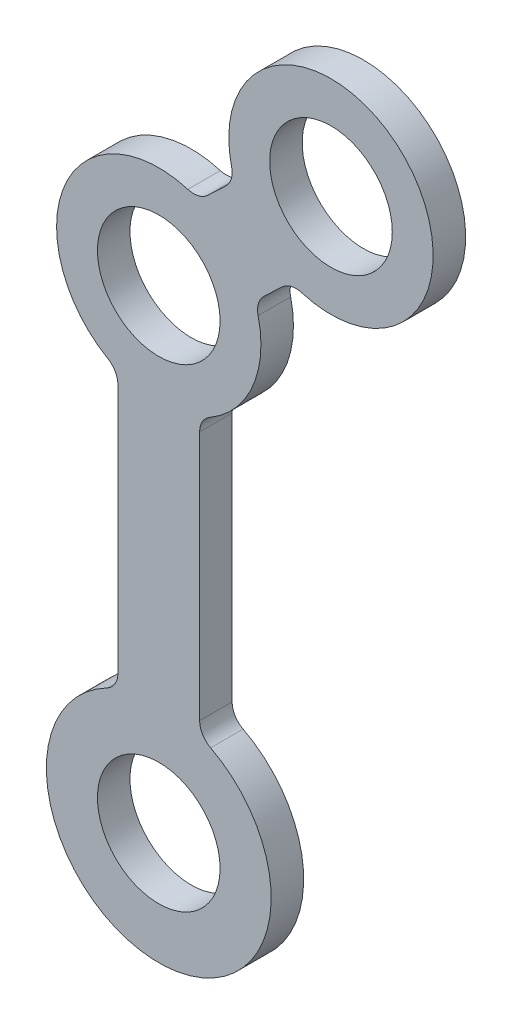
ISO-10303-21;
HEADER;
FILE_DESCRIPTION(('STEP AP214'),'2;1');
FILE_NAME('part.step','',(''),(''),'','','');
FILE_SCHEMA(('AUTOMOTIVE_DESIGN { 1 0 10303 214 1 1 1 1 }'));
ENDSEC;
DATA;
#1=APPLICATION_CONTEXT('core data for automotive mechanical design processes');
#2=APPLICATION_PROTOCOL_DEFINITION('international standard','automotive_design',2000,#1);
#3=PRODUCT_CONTEXT('',#1,'mechanical');
#4=PRODUCT('Part','Part','',(#3));
#5=PRODUCT_RELATED_PRODUCT_CATEGORY('part','',(#4));
#6=PRODUCT_DEFINITION_FORMATION('','',#4);
#7=PRODUCT_DEFINITION_CONTEXT('part definition',#1,'design');
#8=PRODUCT_DEFINITION('design','',#6,#7);
#9=PRODUCT_DEFINITION_SHAPE('','',#8);
#10=(LENGTH_UNIT() NAMED_UNIT(*) SI_UNIT(.MILLI.,.METRE.));
#11=(NAMED_UNIT(*) PLANE_ANGLE_UNIT() SI_UNIT($,.RADIAN.));
#12=(NAMED_UNIT(*) SI_UNIT($,.STERADIAN.) SOLID_ANGLE_UNIT());
#13=UNCERTAINTY_MEASURE_WITH_UNIT(LENGTH_MEASURE(1.E-05),#10,'distance_accuracy_value','');
#14=(GEOMETRIC_REPRESENTATION_CONTEXT(3) GLOBAL_UNCERTAINTY_ASSIGNED_CONTEXT((#13)) GLOBAL_UNIT_ASSIGNED_CONTEXT((#10,
#11,#12)) REPRESENTATION_CONTEXT('',''));
#15=CARTESIAN_POINT('',(0.,0.,0.));
#16=DIRECTION('',(0.,0.,1.));
#17=DIRECTION('',(1.,0.,0.));
#18=AXIS2_PLACEMENT_3D('',#15,#16,#17);
#19=CARTESIAN_POINT('',(-3.,17.9989475772934,1.59));
#20=DIRECTION('',(0.,0.,-1.));
#21=DIRECTION('',(-1.,0.,0.));
#22=AXIS2_PLACEMENT_3D('',#19,#20,#21);
#23=CYLINDRICAL_SURFACE('',#22,1.);
#24=CARTESIAN_POINT('',(-3.,17.9989475772934,0.));
#25=DIRECTION('',(0.,0.,1.));
#26=DIRECTION('',(1.,0.,0.));
#27=AXIS2_PLACEMENT_3D('',#24,#25,#26);
#28=CIRCLE('',#27,1.);
#29=CARTESIAN_POINT('',(-2.,17.9989475772934,0.));
#30=VERTEX_POINT('',#29);
#31=CARTESIAN_POINT('',(-2.5,18.8649729810778,0.));
#32=VERTEX_POINT('',#31);
#33=EDGE_CURVE('E185',#30,#32,#28,.T.);
#34=ORIENTED_EDGE('',*,*,#33,.F.);
#35=DIRECTION('',(0.,0.,-1.));
#36=VECTOR('',#35,1.);
#37=CARTESIAN_POINT('',(-2.,17.9989475772934,1.59));
#38=LINE('',#37,#36);
#39=CARTESIAN_POINT('',(-2.,17.9989475772934,1.59));
#40=VERTEX_POINT('',#39);
#41=EDGE_CURVE('E11',#40,#30,#38,.T.);
#42=ORIENTED_EDGE('',*,*,#41,.F.);
#43=CARTESIAN_POINT('',(-3.,17.9989475772934,1.59));
#44=DIRECTION('',(0.,0.,1.));
#45=DIRECTION('',(1.,0.,0.));
#46=AXIS2_PLACEMENT_3D('',#43,#44,#45);
#47=CIRCLE('',#46,1.);
#48=CARTESIAN_POINT('',(-2.5,18.8649729810778,1.59));
#49=VERTEX_POINT('',#48);
#50=EDGE_CURVE('E232',#40,#49,#47,.T.);
#51=ORIENTED_EDGE('',*,*,#50,.T.);
#52=DIRECTION('',(0.,0.,-1.));
#53=VECTOR('',#52,1.);
#54=CARTESIAN_POINT('',(-2.5,18.8649729810778,1.59));
#55=LINE('',#54,#53);
#56=EDGE_CURVE('E108',#49,#32,#55,.T.);
#57=ORIENTED_EDGE('',*,*,#56,.T.);
#58=EDGE_LOOP('',(#34,#42,#51,#57));
#59=FACE_BOUND('',#58,.T.);
#60=ADVANCED_FACE('F34',(#59),#23,.F.);
#61=CARTESIAN_POINT('',(-2.,0.,1.59));
#62=DIRECTION('',(-1.,0.,0.));
#63=DIRECTION('',(0.,0.,1.));
#64=AXIS2_PLACEMENT_3D('',#61,#62,#63);
#65=PLANE('',#64);
#66=DIRECTION('',(0.,1.,0.));
#67=VECTOR('',#66,1.);
#68=CARTESIAN_POINT('',(-2.,0.,0.));
#69=LINE('',#68,#67);
#70=CARTESIAN_POINT('',(-2.,5.7662812973354,0.));
#71=VERTEX_POINT('',#70);
#72=EDGE_CURVE('E188',#71,#30,#69,.T.);
#73=ORIENTED_EDGE('',*,*,#72,.F.);
#74=DIRECTION('',(0.,0.,-1.));
#75=VECTOR('',#74,1.);
#76=CARTESIAN_POINT('',(-2.,5.7662812973354,1.59));
#77=LINE('',#76,#75);
#78=CARTESIAN_POINT('',(-2.,5.7662812973354,1.59));
#79=VERTEX_POINT('',#78);
#80=EDGE_CURVE('E42',#79,#71,#77,.T.);
#81=ORIENTED_EDGE('',*,*,#80,.F.);
#82=DIRECTION('',(0.,1.,0.));
#83=VECTOR('',#82,1.);
#84=CARTESIAN_POINT('',(-2.,0.,1.59));
#85=LINE('',#84,#83);
#86=EDGE_CURVE('E317',#79,#40,#85,.T.);
#87=ORIENTED_EDGE('',*,*,#86,.T.);
#88=ORIENTED_EDGE('',*,*,#41,.T.);
#89=EDGE_LOOP('',(#73,#81,#87,#88));
#90=FACE_BOUND('',#89,.T.);
#91=ADVANCED_FACE('F270',(#90),#65,.T.);
#92=CARTESIAN_POINT('',(-3.,5.7662812973354,1.59));
#93=DIRECTION('',(0.,0.,-1.));
#94=DIRECTION('',(-1.,0.,0.));
#95=AXIS2_PLACEMENT_3D('',#92,#93,#94);
#96=CYLINDRICAL_SURFACE('',#95,1.);
#97=CARTESIAN_POINT('',(-3.,5.7662812973354,0.));
#98=DIRECTION('',(0.,0.,1.));
#99=DIRECTION('',(1.,0.,0.));
#100=AXIS2_PLACEMENT_3D('',#97,#98,#99);
#101=CIRCLE('',#100,1.);
#102=CARTESIAN_POINT('',(-2.53846153846154,4.87916109774534,0.));
#103=VERTEX_POINT('',#102);
#104=EDGE_CURVE('E191',#103,#71,#101,.T.);
#105=ORIENTED_EDGE('',*,*,#104,.F.);
#106=DIRECTION('',(0.,0.,-1.));
#107=VECTOR('',#106,1.);
#108=CARTESIAN_POINT('',(-2.53846153846154,4.87916109774534,1.59));
#109=LINE('',#108,#107);
#110=CARTESIAN_POINT('',(-2.53846153846154,4.87916109774534,1.59));
#111=VERTEX_POINT('',#110);
#112=EDGE_CURVE('E259',#111,#103,#109,.T.);
#113=ORIENTED_EDGE('',*,*,#112,.F.);
#114=CARTESIAN_POINT('',(-3.,5.7662812973354,1.59));
#115=DIRECTION('',(0.,0.,1.));
#116=DIRECTION('',(1.,0.,0.));
#117=AXIS2_PLACEMENT_3D('',#114,#115,#116);
#118=CIRCLE('',#117,1.);
#119=EDGE_CURVE('E266',#111,#79,#118,.T.);
#120=ORIENTED_EDGE('',*,*,#119,.T.);
#121=ORIENTED_EDGE('',*,*,#80,.T.);
#122=EDGE_LOOP('',(#105,#113,#120,#121));
#123=FACE_BOUND('',#122,.T.);
#124=ADVANCED_FACE('F264',(#123),#96,.F.);
#125=CARTESIAN_POINT('',(0.,0.,1.59));
#126=DIRECTION('',(0.,0.,-1.));
#127=DIRECTION('',(-1.,0.,0.));
#128=AXIS2_PLACEMENT_3D('',#125,#126,#127);
#129=CYLINDRICAL_SURFACE('',#128,5.5);
#130=CARTESIAN_POINT('',(0.,0.,0.));
#131=DIRECTION('',(0.,0.,1.));
#132=DIRECTION('',(1.,0.,0.));
#133=AXIS2_PLACEMENT_3D('',#130,#131,#132);
#134=CIRCLE('',#133,5.5);
#135=CARTESIAN_POINT('',(2.53846153846154,4.87916109774534,0.));
#136=VERTEX_POINT('',#135);
#137=EDGE_CURVE('E194',#103,#136,#134,.T.);
#138=ORIENTED_EDGE('',*,*,#137,.T.);
#139=DIRECTION('',(0.,0.,-1.));
#140=VECTOR('',#139,1.);
#141=CARTESIAN_POINT('',(2.53846153846154,4.87916109774534,1.59));
#142=LINE('',#141,#140);
#143=CARTESIAN_POINT('',(2.53846153846154,4.87916109774534,1.59));
#144=VERTEX_POINT('',#143);
#145=EDGE_CURVE('E256',#144,#136,#142,.T.);
#146=ORIENTED_EDGE('',*,*,#145,.F.);
#147=CARTESIAN_POINT('',(0.,0.,1.59));
#148=DIRECTION('',(0.,0.,1.));
#149=DIRECTION('',(1.,0.,0.));
#150=AXIS2_PLACEMENT_3D('',#147,#148,#149);
#151=CIRCLE('',#150,5.5);
#152=EDGE_CURVE('E288',#111,#144,#151,.T.);
#153=ORIENTED_EDGE('',*,*,#152,.F.);
#154=ORIENTED_EDGE('',*,*,#112,.T.);
#155=EDGE_LOOP('',(#138,#146,#153,#154));
#156=FACE_BOUND('',#155,.T.);
#157=ADVANCED_FACE('F279',(#156),#129,.T.);
#158=CARTESIAN_POINT('',(3.,5.7662812973354,1.59));
#159=DIRECTION('',(0.,0.,-1.));
#160=DIRECTION('',(-1.,0.,0.));
#161=AXIS2_PLACEMENT_3D('',#158,#159,#160);
#162=CYLINDRICAL_SURFACE('',#161,1.);
#163=CARTESIAN_POINT('',(3.,5.7662812973354,0.));
#164=DIRECTION('',(0.,0.,1.));
#165=DIRECTION('',(1.,0.,0.));
#166=AXIS2_PLACEMENT_3D('',#163,#164,#165);
#167=CIRCLE('',#166,1.);
#168=CARTESIAN_POINT('',(2.,5.7662812973354,0.));
#169=VERTEX_POINT('',#168);
#170=EDGE_CURVE('E196',#136,#169,#167,.F.);
#171=ORIENTED_EDGE('',*,*,#170,.T.);
#172=DIRECTION('',(0.,0.,-1.));
#173=VECTOR('',#172,1.);
#174=CARTESIAN_POINT('',(2.,5.7662812973354,1.59));
#175=LINE('',#174,#173);
#176=CARTESIAN_POINT('',(2.,5.7662812973354,1.59));
#177=VERTEX_POINT('',#176);
#178=EDGE_CURVE('E253',#177,#169,#175,.T.);
#179=ORIENTED_EDGE('',*,*,#178,.F.);
#180=CARTESIAN_POINT('',(3.,5.7662812973354,1.59));
#181=DIRECTION('',(0.,0.,1.));
#182=DIRECTION('',(1.,0.,0.));
#183=AXIS2_PLACEMENT_3D('',#180,#181,#182);
#184=CIRCLE('',#183,1.);
#185=EDGE_CURVE('E285',#144,#177,#184,.F.);
#186=ORIENTED_EDGE('',*,*,#185,.F.);
#187=ORIENTED_EDGE('',*,*,#145,.T.);
#188=EDGE_LOOP('',(#171,#179,#186,#187));
#189=FACE_BOUND('',#188,.T.);
#190=ADVANCED_FACE('F283',(#189),#162,.F.);
#191=CARTESIAN_POINT('',(2.,0.,1.59));
#192=DIRECTION('',(-1.,0.,0.));
#193=DIRECTION('',(0.,0.,1.));
#194=AXIS2_PLACEMENT_3D('',#191,#192,#193);
#195=PLANE('',#194);
#196=DIRECTION('',(0.,1.,0.));
#197=VECTOR('',#196,1.);
#198=CARTESIAN_POINT('',(2.,0.,0.));
#199=LINE('',#198,#197);
#200=CARTESIAN_POINT('',(2.,17.9989475772934,0.));
#201=VERTEX_POINT('',#200);
#202=EDGE_CURVE('E198',#169,#201,#199,.T.);
#203=ORIENTED_EDGE('',*,*,#202,.T.);
#204=DIRECTION('',(0.,0.,-1.));
#205=VECTOR('',#204,1.);
#206=CARTESIAN_POINT('',(2.,17.9989475772934,1.59));
#207=LINE('',#206,#205);
#208=CARTESIAN_POINT('',(2.,17.9989475772934,1.59));
#209=VERTEX_POINT('',#208);
#210=EDGE_CURVE('E250',#209,#201,#207,.T.);
#211=ORIENTED_EDGE('',*,*,#210,.F.);
#212=DIRECTION('',(0.,1.,0.));
#213=VECTOR('',#212,1.);
#214=CARTESIAN_POINT('',(2.,0.,1.59));
#215=LINE('',#214,#213);
#216=EDGE_CURVE('E287',#177,#209,#215,.T.);
#217=ORIENTED_EDGE('',*,*,#216,.F.);
#218=ORIENTED_EDGE('',*,*,#178,.T.);
#219=EDGE_LOOP('',(#203,#211,#217,#218));
#220=FACE_BOUND('',#219,.T.);
#221=ADVANCED_FACE('F333',(#220),#195,.F.);
#222=CARTESIAN_POINT('',(3.,17.9989475772934,1.59));
#223=DIRECTION('',(0.,0.,-1.));
#224=DIRECTION('',(-1.,0.,0.));
#225=AXIS2_PLACEMENT_3D('',#222,#223,#224);
#226=CYLINDRICAL_SURFACE('',#225,1.);
#227=CARTESIAN_POINT('',(3.,17.9989475772934,0.));
#228=DIRECTION('',(0.,0.,1.));
#229=DIRECTION('',(1.,0.,0.));
#230=AXIS2_PLACEMENT_3D('',#227,#228,#229);
#231=CIRCLE('',#230,1.);
#232=CARTESIAN_POINT('',(2.5,18.8649729810778,0.));
#233=VERTEX_POINT('',#232);
#234=EDGE_CURVE('E200',#201,#233,#231,.F.);
#235=ORIENTED_EDGE('',*,*,#234,.T.);
#236=DIRECTION('',(0.,0.,-1.));
#237=VECTOR('',#236,1.);
#238=CARTESIAN_POINT('',(2.5,18.8649729810778,1.59));
#239=LINE('',#238,#237);
#240=CARTESIAN_POINT('',(2.5,18.8649729810778,1.59));
#241=VERTEX_POINT('',#240);
#242=EDGE_CURVE('E247',#241,#233,#239,.T.);
#243=ORIENTED_EDGE('',*,*,#242,.F.);
#244=CARTESIAN_POINT('',(3.,17.9989475772934,1.59));
#245=DIRECTION('',(0.,0.,1.));
#246=DIRECTION('',(1.,0.,0.));
#247=AXIS2_PLACEMENT_3D('',#244,#245,#246);
#248=CIRCLE('',#247,1.);
#249=EDGE_CURVE('E290',#209,#241,#248,.F.);
#250=ORIENTED_EDGE('',*,*,#249,.F.);
#251=ORIENTED_EDGE('',*,*,#210,.T.);
#252=EDGE_LOOP('',(#235,#243,#250,#251));
#253=FACE_BOUND('',#252,.T.);
#254=ADVANCED_FACE('F336',(#253),#226,.F.);
#255=CARTESIAN_POINT('',(0.,23.1951,1.59));
#256=DIRECTION('',(0.,0.,-1.));
#257=DIRECTION('',(-1.,0.,0.));
#258=AXIS2_PLACEMENT_3D('',#255,#256,#257);
#259=CYLINDRICAL_SURFACE('',#258,5.);
#260=CARTESIAN_POINT('',(0.,23.1951,0.));
#261=DIRECTION('',(0.,0.,1.));
#262=DIRECTION('',(1.,0.,0.));
#263=AXIS2_PLACEMENT_3D('',#260,#261,#262);
#264=CIRCLE('',#263,5.);
#265=CARTESIAN_POINT('',(4.86249764738519,24.359624207208,0.));
#266=VERTEX_POINT('',#265);
#267=EDGE_CURVE('E202',#233,#266,#264,.T.);
#268=ORIENTED_EDGE('',*,*,#267,.T.);
#269=DIRECTION('',(0.,0.,-1.));
#270=VECTOR('',#269,1.);
#271=CARTESIAN_POINT('',(4.86249764738519,24.359624207208,1.59));
#272=LINE('',#271,#270);
#273=CARTESIAN_POINT('',(4.86249764738519,24.359624207208,1.59));
#274=VERTEX_POINT('',#273);
#275=EDGE_CURVE('E245',#274,#266,#272,.T.);
#276=ORIENTED_EDGE('',*,*,#275,.F.);
#277=CARTESIAN_POINT('',(0.,23.1951,1.59));
#278=DIRECTION('',(0.,0.,1.));
#279=DIRECTION('',(1.,0.,0.));
#280=AXIS2_PLACEMENT_3D('',#277,#278,#279);
#281=CIRCLE('',#280,5.);
#282=EDGE_CURVE('E296',#241,#274,#281,.T.);
#283=ORIENTED_EDGE('',*,*,#282,.F.);
#284=ORIENTED_EDGE('',*,*,#242,.T.);
#285=EDGE_LOOP('',(#268,#276,#283,#284));
#286=FACE_BOUND('',#285,.T.);
#287=ADVANCED_FACE('F340',(#286),#259,.T.);
#288=CARTESIAN_POINT('',(5.83499717686222,24.5925290486496,1.59));
#289=DIRECTION('',(0.,0.,-1.));
#290=DIRECTION('',(-1.,0.,0.));
#291=AXIS2_PLACEMENT_3D('',#288,#289,#290);
#292=CYLINDRICAL_SURFACE('',#291,0.999999999999999);
#293=CARTESIAN_POINT('',(5.83499717686222,24.5925290486496,0.));
#294=DIRECTION('',(0.,0.,1.));
#295=DIRECTION('',(1.,0.,0.));
#296=AXIS2_PLACEMENT_3D('',#293,#294,#295);
#297=CIRCLE('',#296,0.999999999999999);
#298=CARTESIAN_POINT('',(5.14704590277089,25.3182859256244,0.));
#299=VERTEX_POINT('',#298);
#300=EDGE_CURVE('E205',#299,#266,#297,.T.);
#301=ORIENTED_EDGE('',*,*,#300,.F.);
#302=DIRECTION('',(0.,0.,-1.));
#303=VECTOR('',#302,1.);
#304=CARTESIAN_POINT('',(5.14704590277089,25.3182859256244,1.59));
#305=LINE('',#304,#303);
#306=CARTESIAN_POINT('',(5.14704590277089,25.3182859256244,1.59));
#307=VERTEX_POINT('',#306);
#308=EDGE_CURVE('E243',#307,#299,#305,.T.);
#309=ORIENTED_EDGE('',*,*,#308,.F.);
#310=CARTESIAN_POINT('',(5.83499717686222,24.5925290486496,1.59));
#311=DIRECTION('',(0.,0.,1.));
#312=DIRECTION('',(1.,0.,0.));
#313=AXIS2_PLACEMENT_3D('',#310,#311,#312);
#314=CIRCLE('',#313,0.999999999999999);
#315=EDGE_CURVE('E298',#307,#274,#314,.T.);
#316=ORIENTED_EDGE('',*,*,#315,.T.);
#317=ORIENTED_EDGE('',*,*,#275,.T.);
#318=EDGE_LOOP('',(#301,#309,#316,#317));
#319=FACE_BOUND('',#318,.T.);
#320=ADVANCED_FACE('F344',(#319),#292,.F.);
#321=CARTESIAN_POINT('',(-10.2050714956444,10.7658799349782,1.59));
#322=DIRECTION('',(-0.687951274091339,0.725756876974723,0.));
#323=DIRECTION('',(-0.725756876974723,-0.687951274091339,0.));
#324=AXIS2_PLACEMENT_3D('',#321,#322,#323);
#325=PLANE('',#324);
#326=DIRECTION('',(0.725756876974723,0.687951274091339,0.));
#327=VECTOR('',#326,1.);
#328=CARTESIAN_POINT('',(-10.2050714956444,10.7658799349782,0.));
#329=LINE('',#328,#327);
#330=CARTESIAN_POINT('',(6.03028850545712,26.1555192927853,0.));
#331=VERTEX_POINT('',#330);
#332=EDGE_CURVE('E208',#299,#331,#329,.T.);
#333=ORIENTED_EDGE('',*,*,#332,.T.);
#334=DIRECTION('',(0.,0.,-1.));
#335=VECTOR('',#334,1.);
#336=CARTESIAN_POINT('',(6.03028850545712,26.1555192927853,1.59));
#337=LINE('',#336,#335);
#338=CARTESIAN_POINT('',(6.03028850545712,26.1555192927853,1.59));
#339=VERTEX_POINT('',#338);
#340=EDGE_CURVE('E241',#339,#331,#337,.T.);
#341=ORIENTED_EDGE('',*,*,#340,.F.);
#342=DIRECTION('',(0.725756876974723,0.687951274091339,0.));
#343=VECTOR('',#342,1.);
#344=CARTESIAN_POINT('',(-10.2050714956444,10.7658799349782,1.59));
#345=LINE('',#344,#343);
#346=EDGE_CURVE('E301',#307,#339,#345,.T.);
#347=ORIENTED_EDGE('',*,*,#346,.F.);
#348=ORIENTED_EDGE('',*,*,#308,.T.);
#349=EDGE_LOOP('',(#333,#341,#347,#348));
#350=FACE_BOUND('',#349,.T.);
#351=ADVANCED_FACE('F348',(#350),#325,.F.);
#352=CARTESIAN_POINT('',(6.71823977954846,25.4297624158106,1.59));
#353=DIRECTION('',(0.,0.,-1.));
#354=DIRECTION('',(-1.,0.,0.));
#355=AXIS2_PLACEMENT_3D('',#352,#353,#354);
#356=CYLINDRICAL_SURFACE('',#355,1.);
#357=CARTESIAN_POINT('',(6.71823977954846,25.4297624158106,0.));
#358=DIRECTION('',(0.,0.,1.));
#359=DIRECTION('',(1.,0.,0.));
#360=AXIS2_PLACEMENT_3D('',#357,#358,#359);
#361=CIRCLE('',#360,1.);
#362=CARTESIAN_POINT('',(7.00278803493416,26.3884241342269,0.));
#363=VERTEX_POINT('',#362);
#364=EDGE_CURVE('E211',#363,#331,#361,.T.);
#365=ORIENTED_EDGE('',*,*,#364,.F.);
#366=DIRECTION('',(0.,0.,-1.));
#367=VECTOR('',#366,1.);
#368=CARTESIAN_POINT('',(7.00278803493416,26.3884241342269,1.59));
#369=LINE('',#368,#367);
#370=CARTESIAN_POINT('',(7.00278803493416,26.3884241342269,1.59));
#371=VERTEX_POINT('',#370);
#372=EDGE_CURVE('E239',#371,#363,#369,.T.);
#373=ORIENTED_EDGE('',*,*,#372,.F.);
#374=CARTESIAN_POINT('',(6.71823977954846,25.4297624158106,1.59));
#375=DIRECTION('',(0.,0.,1.));
#376=DIRECTION('',(1.,0.,0.));
#377=AXIS2_PLACEMENT_3D('',#374,#375,#376);
#378=CIRCLE('',#377,1.);
#379=EDGE_CURVE('E303',#371,#339,#378,.T.);
#380=ORIENTED_EDGE('',*,*,#379,.T.);
#381=ORIENTED_EDGE('',*,*,#340,.T.);
#382=EDGE_LOOP('',(#365,#373,#380,#381));
#383=FACE_BOUND('',#382,.T.);
#384=ADVANCED_FACE('F352',(#383),#356,.F.);
#385=CARTESIAN_POINT('',(8.42552931186266,31.1817327263086,1.59));
#386=DIRECTION('',(0.,0.,-1.));
#387=DIRECTION('',(-1.,0.,0.));
#388=AXIS2_PLACEMENT_3D('',#385,#386,#387);
#389=CYLINDRICAL_SURFACE('',#388,5.);
#390=CARTESIAN_POINT('',(8.42552931186266,31.1817327263086,0.));
#391=DIRECTION('',(0.,0.,1.));
#392=DIRECTION('',(1.,0.,0.));
#393=AXIS2_PLACEMENT_3D('',#390,#391,#392);
#394=CIRCLE('',#393,5.);
#395=CARTESIAN_POINT('',(3.56303166447747,30.0172085191005,0.));
#396=VERTEX_POINT('',#395);
#397=EDGE_CURVE('E214',#363,#396,#394,.T.);
#398=ORIENTED_EDGE('',*,*,#397,.T.);
#399=DIRECTION('',(0.,0.,-1.));
#400=VECTOR('',#399,1.);
#401=CARTESIAN_POINT('',(3.56303166447747,30.0172085191005,1.59));
#402=LINE('',#401,#400);
#403=CARTESIAN_POINT('',(3.56303166447747,30.0172085191005,1.59));
#404=VERTEX_POINT('',#403);
#405=EDGE_CURVE('E236',#404,#396,#402,.T.);
#406=ORIENTED_EDGE('',*,*,#405,.F.);
#407=CARTESIAN_POINT('',(8.42552931186266,31.1817327263086,1.59));
#408=DIRECTION('',(0.,0.,1.));
#409=DIRECTION('',(1.,0.,0.));
#410=AXIS2_PLACEMENT_3D('',#407,#408,#409);
#411=CIRCLE('',#410,5.);
#412=EDGE_CURVE('E171',#371,#404,#411,.T.);
#413=ORIENTED_EDGE('',*,*,#412,.F.);
#414=ORIENTED_EDGE('',*,*,#372,.T.);
#415=EDGE_LOOP('',(#398,#406,#413,#414));
#416=FACE_BOUND('',#415,.T.);
#417=ADVANCED_FACE('F309',(#416),#389,.T.);
#418=CARTESIAN_POINT('',(2.59053213500044,29.7843036776589,1.59));
#419=DIRECTION('',(0.,0.,-1.));
#420=DIRECTION('',(-1.,0.,0.));
#421=AXIS2_PLACEMENT_3D('',#418,#419,#420);
#422=CYLINDRICAL_SURFACE('',#421,1.);
#423=CARTESIAN_POINT('',(2.59053213500044,29.7843036776589,0.));
#424=DIRECTION('',(0.,0.,1.));
#425=DIRECTION('',(1.,0.,0.));
#426=AXIS2_PLACEMENT_3D('',#423,#424,#425);
#427=CIRCLE('',#426,1.);
#428=CARTESIAN_POINT('',(3.27848340909177,29.0585468006842,0.));
#429=VERTEX_POINT('',#428);
#430=EDGE_CURVE('E216',#396,#429,#427,.F.);
#431=ORIENTED_EDGE('',*,*,#430,.T.);
#432=DIRECTION('',(0.,0.,-1.));
#433=VECTOR('',#432,1.);
#434=CARTESIAN_POINT('',(3.27848340909177,29.0585468006842,1.59));
#435=LINE('',#434,#433);
#436=CARTESIAN_POINT('',(3.27848340909177,29.0585468006842,1.59));
#437=VERTEX_POINT('',#436);
#438=EDGE_CURVE('E159',#437,#429,#435,.T.);
#439=ORIENTED_EDGE('',*,*,#438,.F.);
#440=CARTESIAN_POINT('',(2.59053213500044,29.7843036776589,1.59));
#441=DIRECTION('',(0.,0.,1.));
#442=DIRECTION('',(1.,0.,0.));
#443=AXIS2_PLACEMENT_3D('',#440,#441,#442);
#444=CIRCLE('',#443,1.);
#445=EDGE_CURVE('E168',#404,#437,#444,.F.);
#446=ORIENTED_EDGE('',*,*,#445,.F.);
#447=ORIENTED_EDGE('',*,*,#405,.T.);
#448=EDGE_LOOP('',(#431,#439,#446,#447));
#449=FACE_BOUND('',#448,.T.);
#450=ADVANCED_FACE('F313',(#449),#422,.F.);
#451=CARTESIAN_POINT('',(-12.9568765920098,13.6689074428771,1.59));
#452=DIRECTION('',(-0.687951274091339,0.725756876974723,0.));
#453=DIRECTION('',(-0.725756876974723,-0.687951274091339,0.));
#454=AXIS2_PLACEMENT_3D('',#451,#452,#453);
#455=PLANE('',#454);
#456=DIRECTION('',(0.725756876974723,0.687951274091339,0.));
#457=VECTOR('',#456,1.);
#458=CARTESIAN_POINT('',(-12.9568765920098,13.6689074428771,0.));
#459=LINE('',#458,#457);
#460=CARTESIAN_POINT('',(2.39524080640554,28.2213134335233,0.));
#461=VERTEX_POINT('',#460);
#462=EDGE_CURVE('E158',#461,#429,#459,.T.);
#463=ORIENTED_EDGE('',*,*,#462,.F.);
#464=DIRECTION('',(0.,0.,-1.));
#465=VECTOR('',#464,1.);
#466=CARTESIAN_POINT('',(2.39524080640554,28.2213134335233,1.59));
#467=LINE('',#466,#465);
#468=CARTESIAN_POINT('',(2.39524080640554,28.2213134335233,1.59));
#469=VERTEX_POINT('',#468);
#470=EDGE_CURVE('E152',#469,#461,#467,.T.);
#471=ORIENTED_EDGE('',*,*,#470,.F.);
#472=DIRECTION('',(0.725756876974723,0.687951274091339,0.));
#473=VECTOR('',#472,1.);
#474=CARTESIAN_POINT('',(-12.9568765920098,13.6689074428771,1.59));
#475=LINE('',#474,#473);
#476=EDGE_CURVE('E156',#469,#437,#475,.T.);
#477=ORIENTED_EDGE('',*,*,#476,.T.);
#478=ORIENTED_EDGE('',*,*,#438,.T.);
#479=EDGE_LOOP('',(#463,#471,#477,#478));
#480=FACE_BOUND('',#479,.T.);
#481=ADVANCED_FACE('F154',(#480),#455,.T.);
#482=CARTESIAN_POINT('',(1.7072895323142,28.947070310498,1.59));
#483=DIRECTION('',(0.,0.,-1.));
#484=DIRECTION('',(-1.,0.,0.));
#485=AXIS2_PLACEMENT_3D('',#482,#483,#484);
#486=CYLINDRICAL_SURFACE('',#485,1.);
#487=CARTESIAN_POINT('',(1.7072895323142,28.947070310498,0.));
#488=DIRECTION('',(0.,0.,1.));
#489=DIRECTION('',(1.,0.,0.));
#490=AXIS2_PLACEMENT_3D('',#487,#488,#489);
#491=CIRCLE('',#490,1.);
#492=CARTESIAN_POINT('',(1.4227412769285,27.9884085920817,0.));
#493=VERTEX_POINT('',#492);
#494=EDGE_CURVE('E101',#461,#493,#491,.F.);
#495=ORIENTED_EDGE('',*,*,#494,.T.);
#496=DIRECTION('',(0.,0.,-1.));
#497=VECTOR('',#496,1.);
#498=CARTESIAN_POINT('',(1.4227412769285,27.9884085920817,1.59));
#499=LINE('',#498,#497);
#500=CARTESIAN_POINT('',(1.4227412769285,27.9884085920817,1.59));
#501=VERTEX_POINT('',#500);
#502=EDGE_CURVE('E160',#501,#493,#499,.T.);
#503=ORIENTED_EDGE('',*,*,#502,.F.);
#504=CARTESIAN_POINT('',(1.7072895323142,28.947070310498,1.59));
#505=DIRECTION('',(0.,0.,1.));
#506=DIRECTION('',(1.,0.,0.));
#507=AXIS2_PLACEMENT_3D('',#504,#505,#506);
#508=CIRCLE('',#507,1.);
#509=EDGE_CURVE('E162',#469,#501,#508,.F.);
#510=ORIENTED_EDGE('',*,*,#509,.F.);
#511=ORIENTED_EDGE('',*,*,#470,.T.);
#512=EDGE_LOOP('',(#495,#503,#510,#511));
#513=FACE_BOUND('',#512,.T.);
#514=ADVANCED_FACE('F163',(#513),#486,.F.);
#515=CARTESIAN_POINT('',(0.,23.1951,1.59));
#516=DIRECTION('',(0.,0.,-1.));
#517=DIRECTION('',(-1.,0.,0.));
#518=AXIS2_PLACEMENT_3D('',#515,#516,#517);
#519=CYLINDRICAL_SURFACE('',#518,3.);
#520=CARTESIAN_POINT('',(0.,23.1951,1.59));
#521=DIRECTION('',(0.,0.,1.));
#522=DIRECTION('',(1.,0.,0.));
#523=AXIS2_PLACEMENT_3D('',#520,#521,#522);
#524=CIRCLE('',#523,3.);
#525=CARTESIAN_POINT('',(3.,23.1951,1.59));
#526=VERTEX_POINT('',#525);
#527=EDGE_CURVE('E179',#526,#526,#524,.T.);
#528=ORIENTED_EDGE('',*,*,#527,.T.);
#529=EDGE_LOOP('',(#528));
#530=FACE_BOUND('',#529,.T.);
#531=CARTESIAN_POINT('',(0.,23.1951,0.));
#532=DIRECTION('',(0.,0.,1.));
#533=DIRECTION('',(1.,0.,0.));
#534=AXIS2_PLACEMENT_3D('',#531,#532,#533);
#535=CIRCLE('',#534,3.);
#536=CARTESIAN_POINT('',(3.,23.1951,0.));
#537=VERTEX_POINT('',#536);
#538=EDGE_CURVE('E226',#537,#537,#535,.T.);
#539=ORIENTED_EDGE('',*,*,#538,.F.);
#540=EDGE_LOOP('',(#539));
#541=FACE_BOUND('',#540,.T.);
#542=ADVANCED_FACE('F365',(#530,#541),#519,.F.);
#543=CARTESIAN_POINT('',(8.42552931186266,31.1817327263086,1.59));
#544=DIRECTION('',(0.,0.,-1.));
#545=DIRECTION('',(-1.,0.,0.));
#546=AXIS2_PLACEMENT_3D('',#543,#544,#545);
#547=CYLINDRICAL_SURFACE('',#546,3.);
#548=CARTESIAN_POINT('',(8.42552931186266,31.1817327263086,1.59));
#549=DIRECTION('',(0.,0.,1.));
#550=DIRECTION('',(1.,0.,0.));
#551=AXIS2_PLACEMENT_3D('',#548,#549,#550);
#552=CIRCLE('',#551,3.);
#553=CARTESIAN_POINT('',(11.4255293118627,31.1817327263086,1.59));
#554=VERTEX_POINT('',#553);
#555=EDGE_CURVE('E176',#554,#554,#552,.T.);
#556=ORIENTED_EDGE('',*,*,#555,.T.);
#557=EDGE_LOOP('',(#556));
#558=FACE_BOUND('',#557,.T.);
#559=CARTESIAN_POINT('',(8.42552931186266,31.1817327263086,0.));
#560=DIRECTION('',(0.,0.,1.));
#561=DIRECTION('',(1.,0.,0.));
#562=AXIS2_PLACEMENT_3D('',#559,#560,#561);
#563=CIRCLE('',#562,3.);
#564=CARTESIAN_POINT('',(11.4255293118627,31.1817327263086,0.));
#565=VERTEX_POINT('',#564);
#566=EDGE_CURVE('E223',#565,#565,#563,.T.);
#567=ORIENTED_EDGE('',*,*,#566,.F.);
#568=EDGE_LOOP('',(#567));
#569=FACE_BOUND('',#568,.T.);
#570=ADVANCED_FACE('F369',(#558,#569),#547,.F.);
#571=CARTESIAN_POINT('',(0.,23.1951,1.59));
#572=DIRECTION('',(0.,0.,-1.));
#573=DIRECTION('',(-1.,0.,0.));
#574=AXIS2_PLACEMENT_3D('',#571,#572,#573);
#575=CYLINDRICAL_SURFACE('',#574,5.);
#576=CARTESIAN_POINT('',(0.,23.1951,0.));
#577=DIRECTION('',(0.,0.,1.));
#578=DIRECTION('',(1.,0.,0.));
#579=AXIS2_PLACEMENT_3D('',#576,#577,#578);
#580=CIRCLE('',#579,5.);
#581=EDGE_CURVE('E221',#493,#32,#580,.T.);
#582=ORIENTED_EDGE('',*,*,#581,.T.);
#583=ORIENTED_EDGE('',*,*,#56,.F.);
#584=CARTESIAN_POINT('',(0.,23.1951,1.59));
#585=DIRECTION('',(0.,0.,1.));
#586=DIRECTION('',(1.,0.,0.));
#587=AXIS2_PLACEMENT_3D('',#584,#585,#586);
#588=CIRCLE('',#587,5.);
#589=EDGE_CURVE('E50',#501,#49,#588,.T.);
#590=ORIENTED_EDGE('',*,*,#589,.F.);
#591=ORIENTED_EDGE('',*,*,#502,.T.);
#592=EDGE_LOOP('',(#582,#583,#590,#591));
#593=FACE_BOUND('',#592,.T.);
#594=ADVANCED_FACE('F316',(#593),#575,.T.);
#595=CARTESIAN_POINT('',(0.,0.,1.59));
#596=DIRECTION('',(0.,0.,-1.));
#597=DIRECTION('',(-1.,0.,0.));
#598=AXIS2_PLACEMENT_3D('',#595,#596,#597);
#599=CYLINDRICAL_SURFACE('',#598,3.);
#600=CARTESIAN_POINT('',(0.,0.,1.59));
#601=DIRECTION('',(0.,0.,1.));
#602=DIRECTION('',(1.,0.,0.));
#603=AXIS2_PLACEMENT_3D('',#600,#601,#602);
#604=CIRCLE('',#603,3.);
#605=CARTESIAN_POINT('',(3.,0.,1.59));
#606=VERTEX_POINT('',#605);
#607=EDGE_CURVE('E182',#606,#606,#604,.T.);
#608=ORIENTED_EDGE('',*,*,#607,.T.);
#609=EDGE_LOOP('',(#608));
#610=FACE_BOUND('',#609,.T.);
#611=CARTESIAN_POINT('',(0.,0.,0.));
#612=DIRECTION('',(0.,0.,1.));
#613=DIRECTION('',(1.,0.,0.));
#614=AXIS2_PLACEMENT_3D('',#611,#612,#613);
#615=CIRCLE('',#614,3.);
#616=CARTESIAN_POINT('',(3.,0.,0.));
#617=VERTEX_POINT('',#616);
#618=EDGE_CURVE('E229',#617,#617,#615,.T.);
#619=ORIENTED_EDGE('',*,*,#618,.F.);
#620=EDGE_LOOP('',(#619));
#621=FACE_BOUND('',#620,.T.);
#622=ADVANCED_FACE('F368',(#610,#621),#599,.F.);
#623=CARTESIAN_POINT('',(0.,0.,1.59));
#624=DIRECTION('',(0.,0.,1.));
#625=DIRECTION('',(1.,0.,0.));
#626=AXIS2_PLACEMENT_3D('',#623,#624,#625);
#627=PLANE('',#626);
#628=ORIENTED_EDGE('',*,*,#50,.F.);
#629=ORIENTED_EDGE('',*,*,#86,.F.);
#630=ORIENTED_EDGE('',*,*,#119,.F.);
#631=ORIENTED_EDGE('',*,*,#152,.T.);
#632=ORIENTED_EDGE('',*,*,#185,.T.);
#633=ORIENTED_EDGE('',*,*,#216,.T.);
#634=ORIENTED_EDGE('',*,*,#249,.T.);
#635=ORIENTED_EDGE('',*,*,#282,.T.);
#636=ORIENTED_EDGE('',*,*,#315,.F.);
#637=ORIENTED_EDGE('',*,*,#346,.T.);
#638=ORIENTED_EDGE('',*,*,#379,.F.);
#639=ORIENTED_EDGE('',*,*,#412,.T.);
#640=ORIENTED_EDGE('',*,*,#445,.T.);
#641=ORIENTED_EDGE('',*,*,#476,.F.);
#642=ORIENTED_EDGE('',*,*,#509,.T.);
#643=ORIENTED_EDGE('',*,*,#589,.T.);
#644=EDGE_LOOP('',(#628,#629,#630,#631,#632,#633,#634,#635,#636,#637,#638,#639,#640,#641,#642,#643));
#645=FACE_BOUND('',#644,.T.);
#646=ORIENTED_EDGE('',*,*,#555,.F.);
#647=EDGE_LOOP('',(#646));
#648=FACE_BOUND('',#647,.T.);
#649=ORIENTED_EDGE('',*,*,#527,.F.);
#650=EDGE_LOOP('',(#649));
#651=FACE_BOUND('',#650,.T.);
#652=ORIENTED_EDGE('',*,*,#607,.F.);
#653=EDGE_LOOP('',(#652));
#654=FACE_BOUND('',#653,.T.);
#655=ADVANCED_FACE('F165',(#645,#648,#651,#654),#627,.T.);
#656=CARTESIAN_POINT('',(0.,0.,0.));
#657=DIRECTION('',(0.,0.,1.));
#658=DIRECTION('',(1.,0.,0.));
#659=AXIS2_PLACEMENT_3D('',#656,#657,#658);
#660=PLANE('',#659);
#661=ORIENTED_EDGE('',*,*,#33,.T.);
#662=ORIENTED_EDGE('',*,*,#581,.F.);
#663=ORIENTED_EDGE('',*,*,#494,.F.);
#664=ORIENTED_EDGE('',*,*,#462,.T.);
#665=ORIENTED_EDGE('',*,*,#430,.F.);
#666=ORIENTED_EDGE('',*,*,#397,.F.);
#667=ORIENTED_EDGE('',*,*,#364,.T.);
#668=ORIENTED_EDGE('',*,*,#332,.F.);
#669=ORIENTED_EDGE('',*,*,#300,.T.);
#670=ORIENTED_EDGE('',*,*,#267,.F.);
#671=ORIENTED_EDGE('',*,*,#234,.F.);
#672=ORIENTED_EDGE('',*,*,#202,.F.);
#673=ORIENTED_EDGE('',*,*,#170,.F.);
#674=ORIENTED_EDGE('',*,*,#137,.F.);
#675=ORIENTED_EDGE('',*,*,#104,.T.);
#676=ORIENTED_EDGE('',*,*,#72,.T.);
#677=EDGE_LOOP('',(#661,#662,#663,#664,#665,#666,#667,#668,#669,#670,#671,#672,#673,#674,#675,#676));
#678=FACE_BOUND('',#677,.T.);
#679=ORIENTED_EDGE('',*,*,#566,.T.);
#680=EDGE_LOOP('',(#679));
#681=FACE_BOUND('',#680,.T.);
#682=ORIENTED_EDGE('',*,*,#538,.T.);
#683=EDGE_LOOP('',(#682));
#684=FACE_BOUND('',#683,.T.);
#685=ORIENTED_EDGE('',*,*,#618,.T.);
#686=EDGE_LOOP('',(#685));
#687=FACE_BOUND('',#686,.T.);
#688=ADVANCED_FACE('F273',(#678,#681,#684,#687),#660,.F.);
#689=CLOSED_SHELL('',(#60,#91,#124,#157,#190,#221,#254,#287,#320,#351,#384,#417,#450,#481,#514,
#542,#570,#594,#622,#655,#688));
#690=MANIFOLD_SOLID_BREP('B2',#689);
#691=ADVANCED_BREP_SHAPE_REPRESENTATION('',(#18,#690),#14);
#692=SHAPE_DEFINITION_REPRESENTATION(#9,#691);
ENDSEC;
END-ISO-10303-21;
